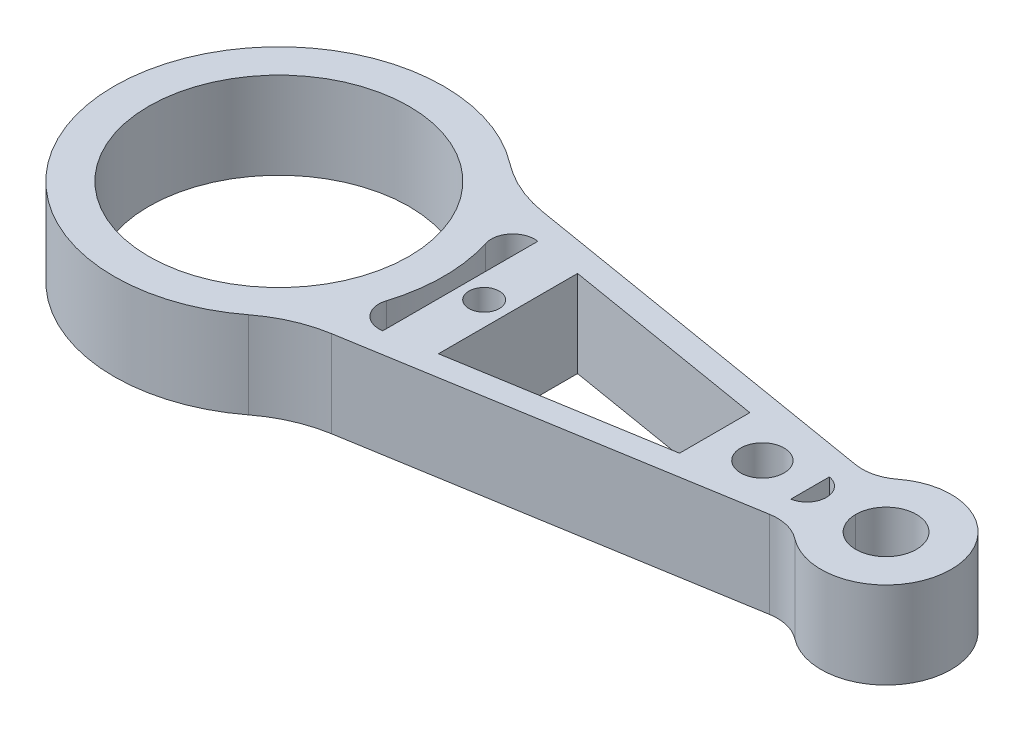
ISO-10303-21;
HEADER;
FILE_DESCRIPTION(('STEP AP214'),'2;1');
FILE_NAME('part.step','',(''),(''),'','','');
FILE_SCHEMA(('AUTOMOTIVE_DESIGN { 1 0 10303 214 1 1 1 1 }'));
ENDSEC;
DATA;
#1=APPLICATION_CONTEXT('core data for automotive mechanical design processes');
#2=APPLICATION_PROTOCOL_DEFINITION('international standard','automotive_design',2000,#1);
#3=PRODUCT_CONTEXT('',#1,'mechanical');
#4=PRODUCT('Part','Part','',(#3));
#5=PRODUCT_RELATED_PRODUCT_CATEGORY('part','',(#4));
#6=PRODUCT_DEFINITION_FORMATION('','',#4);
#7=PRODUCT_DEFINITION_CONTEXT('part definition',#1,'design');
#8=PRODUCT_DEFINITION('design','',#6,#7);
#9=PRODUCT_DEFINITION_SHAPE('','',#8);
#10=(LENGTH_UNIT() NAMED_UNIT(*) SI_UNIT(.MILLI.,.METRE.));
#11=(NAMED_UNIT(*) PLANE_ANGLE_UNIT() SI_UNIT($,.RADIAN.));
#12=(NAMED_UNIT(*) SI_UNIT($,.STERADIAN.) SOLID_ANGLE_UNIT());
#13=UNCERTAINTY_MEASURE_WITH_UNIT(LENGTH_MEASURE(1.E-05),#10,'distance_accuracy_value','');
#14=(GEOMETRIC_REPRESENTATION_CONTEXT(3) GLOBAL_UNCERTAINTY_ASSIGNED_CONTEXT((#13)) GLOBAL_UNIT_ASSIGNED_CONTEXT((#10,
#11,#12)) REPRESENTATION_CONTEXT('',''));
#15=CARTESIAN_POINT('',(0.,0.,0.));
#16=DIRECTION('',(0.,0.,1.));
#17=DIRECTION('',(1.,0.,0.));
#18=AXIS2_PLACEMENT_3D('',#15,#16,#17);
#19=CARTESIAN_POINT('',(140.,10.,0.));
#20=DIRECTION('',(0.,-1.,0.));
#21=DIRECTION('',(0.,0.,-1.));
#22=AXIS2_PLACEMENT_3D('',#19,#20,#21);
#23=CYLINDRICAL_SURFACE('',#22,7.00000000000001);
#24=CARTESIAN_POINT('',(140.,10.,0.));
#25=DIRECTION('',(0.,1.,0.));
#26=DIRECTION('',(0.,0.,1.));
#27=AXIS2_PLACEMENT_3D('',#24,#25,#26);
#28=CIRCLE('',#27,7.00000000000001);
#29=CARTESIAN_POINT('',(147.,10.,0.));
#30=VERTEX_POINT('',#29);
#31=CARTESIAN_POINT('',(133.,10.,0.));
#32=VERTEX_POINT('',#31);
#33=EDGE_CURVE('E316',#30,#32,#28,.T.);
#34=ORIENTED_EDGE('',*,*,#33,.T.);
#35=DIRECTION('',(0.,-1.,0.));
#36=VECTOR('',#35,1.);
#37=CARTESIAN_POINT('',(133.,10.,0.));
#38=LINE('',#37,#36);
#39=CARTESIAN_POINT('',(133.,-10.,0.));
#40=VERTEX_POINT('',#39);
#41=EDGE_CURVE('E11',#32,#40,#38,.T.);
#42=ORIENTED_EDGE('',*,*,#41,.T.);
#43=CARTESIAN_POINT('',(140.,-10.,0.));
#44=DIRECTION('',(0.,1.,0.));
#45=DIRECTION('',(0.,0.,1.));
#46=AXIS2_PLACEMENT_3D('',#43,#44,#45);
#47=CIRCLE('',#46,7.00000000000001);
#48=CARTESIAN_POINT('',(147.,-10.,0.));
#49=VERTEX_POINT('',#48);
#50=EDGE_CURVE('E300',#49,#40,#47,.T.);
#51=ORIENTED_EDGE('',*,*,#50,.F.);
#52=DIRECTION('',(0.,1.,0.));
#53=VECTOR('',#52,1.);
#54=CARTESIAN_POINT('',(147.,10.,0.));
#55=LINE('',#54,#53);
#56=EDGE_CURVE('E52',#49,#30,#55,.T.);
#57=ORIENTED_EDGE('',*,*,#56,.T.);
#58=EDGE_LOOP('',(#34,#42,#51,#57));
#59=FACE_BOUND('',#58,.T.);
#60=ADVANCED_FACE('F43',(#59),#23,.F.);
#61=CARTESIAN_POINT('',(0.,10.,0.));
#62=DIRECTION('',(0.,1.,0.));
#63=DIRECTION('',(0.,0.,1.));
#64=AXIS2_PLACEMENT_3D('',#61,#62,#63);
#65=PLANE('',#64);
#66=CARTESIAN_POINT('',(47.3285545583335,10.,0.));
#67=DIRECTION('',(0.,1.,0.));
#68=DIRECTION('',(0.,0.,1.));
#69=AXIS2_PLACEMENT_3D('',#66,#67,#68);
#70=CIRCLE('',#69,3.5);
#71=CARTESIAN_POINT('',(47.3285545583335,10.,3.5));
#72=VERTEX_POINT('',#71);
#73=EDGE_CURVE('E418',#72,#72,#70,.T.);
#74=ORIENTED_EDGE('',*,*,#73,.F.);
#75=EDGE_LOOP('',(#74));
#76=FACE_BOUND('',#75,.T.);
#77=CARTESIAN_POINT('',(111.478416149068,10.,0.));
#78=DIRECTION('',(0.,1.,0.));
#79=DIRECTION('',(0.,0.,1.));
#80=AXIS2_PLACEMENT_3D('',#77,#78,#79);
#81=CIRCLE('',#80,5.);
#82=CARTESIAN_POINT('',(111.478416149068,10.,5.));
#83=VERTEX_POINT('',#82);
#84=EDGE_CURVE('E410',#83,#83,#81,.T.);
#85=ORIENTED_EDGE('',*,*,#84,.F.);
#86=EDGE_LOOP('',(#85));
#87=FACE_BOUND('',#86,.T.);
#88=DIRECTION('',(-0.986412795984335,0.,-0.164285714285714));
#89=VECTOR('',#88,1.);
#90=CARTESIAN_POINT('',(41.8285545583335,10.,-17.8709827250915));
#91=LINE('',#90,#89);
#92=CARTESIAN_POINT('',(100.478416149068,10.,-8.10292776532473));
#93=VERTEX_POINT('',#92);
#94=CARTESIAN_POINT('',(52.8285545583335,10.,-16.0389476333938));
#95=VERTEX_POINT('',#94);
#96=EDGE_CURVE('E185',#93,#95,#91,.T.);
#97=ORIENTED_EDGE('',*,*,#96,.F.);
#98=DIRECTION('',(0.,0.,1.));
#99=VECTOR('',#98,1.);
#100=CARTESIAN_POINT('',(100.478416149068,10.,8.10292776532473));
#101=LINE('',#100,#99);
#102=CARTESIAN_POINT('',(100.478416149068,10.,8.10292776532473));
#103=VERTEX_POINT('',#102);
#104=EDGE_CURVE('E203',#93,#103,#101,.T.);
#105=ORIENTED_EDGE('',*,*,#104,.T.);
#106=DIRECTION('',(0.986412795984335,0.,-0.164285714285714));
#107=VECTOR('',#106,1.);
#108=CARTESIAN_POINT('',(122.478416149068,10.,4.4388575819295));
#109=LINE('',#108,#107);
#110=CARTESIAN_POINT('',(52.8285545583335,10.,16.0389476333938));
#111=VERTEX_POINT('',#110);
#112=EDGE_CURVE('E186',#111,#103,#109,.T.);
#113=ORIENTED_EDGE('',*,*,#112,.F.);
#114=DIRECTION('',(0.,0.,-1.));
#115=VECTOR('',#114,1.);
#116=CARTESIAN_POINT('',(52.8285545583335,10.,-16.0389476333938));
#117=LINE('',#116,#115);
#118=EDGE_CURVE('E227',#111,#95,#117,.T.);
#119=ORIENTED_EDGE('',*,*,#118,.T.);
#120=EDGE_LOOP('',(#97,#105,#113,#119));
#121=FACE_BOUND('',#120,.T.);
#122=CARTESIAN_POINT('',(41.0071259869049,10.,-12.9389187451698));
#123=DIRECTION('',(0.,1.,0.));
#124=DIRECTION('',(0.,0.,-1.));
#125=AXIS2_PLACEMENT_3D('',#122,#123,#124);
#126=CIRCLE('',#125,5.);
#127=CARTESIAN_POINT('',(41.8285545583335,10.,-17.8709827250915));
#128=VERTEX_POINT('',#127);
#129=CARTESIAN_POINT('',(36.2388555233113,10.,-11.4343933096849));
#130=VERTEX_POINT('',#129);
#131=EDGE_CURVE('E242',#128,#130,#126,.T.);
#132=ORIENTED_EDGE('',*,*,#131,.F.);
#133=DIRECTION('',(0.,0.,1.));
#134=VECTOR('',#133,1.);
#135=CARTESIAN_POINT('',(41.8285545583335,10.,17.8709827250915));
#136=LINE('',#135,#134);
#137=CARTESIAN_POINT('',(41.8285545583335,10.,17.8709827250915));
#138=VERTEX_POINT('',#137);
#139=EDGE_CURVE('E217',#128,#138,#136,.T.);
#140=ORIENTED_EDGE('',*,*,#139,.T.);
#141=CARTESIAN_POINT('',(41.0071259869049,10.,12.9389187451698));
#142=DIRECTION('',(0.,1.,0.));
#143=DIRECTION('',(0.,0.,1.));
#144=AXIS2_PLACEMENT_3D('',#141,#142,#143);
#145=CIRCLE('',#144,5.);
#146=CARTESIAN_POINT('',(36.2388555233113,10.,11.4343933096849));
#147=VERTEX_POINT('',#146);
#148=EDGE_CURVE('E272',#147,#138,#145,.T.);
#149=ORIENTED_EDGE('',*,*,#148,.F.);
#150=CARTESIAN_POINT('',(0.,10.,0.));
#151=DIRECTION('',(0.,-1.,0.));
#152=DIRECTION('',(0.,0.,-1.));
#153=AXIS2_PLACEMENT_3D('',#150,#151,#152);
#154=CIRCLE('',#153,38.);
#155=EDGE_CURVE('E268',#130,#147,#154,.T.);
#156=ORIENTED_EDGE('',*,*,#155,.F.);
#157=EDGE_LOOP('',(#132,#140,#149,#156));
#158=FACE_BOUND('',#157,.T.);
#159=ORIENTED_EDGE('',*,*,#33,.F.);
#160=EDGE_CURVE('E315',#32,#30,#28,.T.);
#161=ORIENTED_EDGE('',*,*,#160,.F.);
#162=EDGE_LOOP('',(#159,#161));
#163=FACE_BOUND('',#162,.T.);
#164=DIRECTION('',(-0.986412795984335,0.,0.164285714285714));
#165=VECTOR('',#164,1.);
#166=CARTESIAN_POINT('',(4.92857142857143,10.,29.59238387953));
#167=LINE('',#166,#165);
#168=CARTESIAN_POINT('',(123.068754783715,10.,9.91629645714705));
#169=VERTEX_POINT('',#168);
#170=CARTESIAN_POINT('',(36.4937809000701,10.,24.3352410223872));
#171=VERTEX_POINT('',#170);
#172=EDGE_CURVE('E312',#169,#171,#167,.T.);
#173=ORIENTED_EDGE('',*,*,#172,.F.);
#174=CARTESIAN_POINT('',(124.711611926572,10.,19.7804244169904));
#175=DIRECTION('',(0.,1.,0.));
#176=DIRECTION('',(0.,0.,1.));
#177=AXIS2_PLACEMENT_3D('',#174,#175,#176);
#178=CIRCLE('',#177,10.);
#179=CARTESIAN_POINT('',(130.826967155943,10.,11.8682546501942));
#180=VERTEX_POINT('',#179);
#181=EDGE_CURVE('E386',#169,#180,#178,.F.);
#182=ORIENTED_EDGE('',*,*,#181,.T.);
#183=CARTESIAN_POINT('',(140.,10.,0.));
#184=DIRECTION('',(0.,1.,0.));
#185=DIRECTION('',(0.,0.,1.));
#186=AXIS2_PLACEMENT_3D('',#183,#184,#185);
#187=CIRCLE('',#186,15.);
#188=CARTESIAN_POINT('',(130.826967155943,10.,-11.8682546501942));
#189=VERTEX_POINT('',#188);
#190=EDGE_CURVE('E299',#180,#189,#187,.T.);
#191=ORIENTED_EDGE('',*,*,#190,.T.);
#192=CARTESIAN_POINT('',(124.711611926572,10.,-19.7804244169904));
#193=DIRECTION('',(0.,1.,0.));
#194=DIRECTION('',(0.,0.,1.));
#195=AXIS2_PLACEMENT_3D('',#192,#193,#194);
#196=CIRCLE('',#195,10.);
#197=CARTESIAN_POINT('',(123.068754783715,10.,-9.91629645714703));
#198=VERTEX_POINT('',#197);
#199=EDGE_CURVE('E392',#189,#198,#196,.F.);
#200=ORIENTED_EDGE('',*,*,#199,.T.);
#201=DIRECTION('',(0.986412795984335,0.,0.164285714285714));
#202=VECTOR('',#201,1.);
#203=CARTESIAN_POINT('',(4.92857142857143,10.,-29.59238387953));
#204=LINE('',#203,#202);
#205=CARTESIAN_POINT('',(36.4937809000701,10.,-24.3352410223872));
#206=VERTEX_POINT('',#205);
#207=EDGE_CURVE('E304',#206,#198,#204,.T.);
#208=ORIENTED_EDGE('',*,*,#207,.F.);
#209=CARTESIAN_POINT('',(41.4223523286415,10.,-53.9276249019172));
#210=DIRECTION('',(0.,1.,0.));
#211=DIRECTION('',(0.,0.,1.));
#212=AXIS2_PLACEMENT_3D('',#209,#210,#211);
#213=CIRCLE('',#212,30.);
#214=CARTESIAN_POINT('',(23.1477851248291,10.,-30.1360256804832));
#215=VERTEX_POINT('',#214);
#216=EDGE_CURVE('E366',#206,#215,#213,.F.);
#217=ORIENTED_EDGE('',*,*,#216,.T.);
#218=CARTESIAN_POINT('',(0.,10.,0.));
#219=DIRECTION('',(0.,1.,0.));
#220=DIRECTION('',(0.,0.,1.));
#221=AXIS2_PLACEMENT_3D('',#218,#219,#220);
#222=CIRCLE('',#221,38.);
#223=CARTESIAN_POINT('',(23.1477851248291,10.,30.1360256804832));
#224=VERTEX_POINT('',#223);
#225=EDGE_CURVE('E308',#215,#224,#222,.T.);
#226=ORIENTED_EDGE('',*,*,#225,.T.);
#227=CARTESIAN_POINT('',(41.4223523286415,10.,53.9276249019172));
#228=DIRECTION('',(0.,1.,0.));
#229=DIRECTION('',(0.,0.,1.));
#230=AXIS2_PLACEMENT_3D('',#227,#228,#229);
#231=CIRCLE('',#230,30.);
#232=EDGE_CURVE('E359',#224,#171,#231,.F.);
#233=ORIENTED_EDGE('',*,*,#232,.T.);
#234=EDGE_LOOP('',(#173,#182,#191,#200,#208,#217,#226,#233));
#235=FACE_BOUND('',#234,.T.);
#236=CARTESIAN_POINT('',(0.,10.,0.));
#237=DIRECTION('',(0.,1.,0.));
#238=DIRECTION('',(0.,0.,1.));
#239=AXIS2_PLACEMENT_3D('',#236,#237,#238);
#240=CIRCLE('',#239,30.);
#241=CARTESIAN_POINT('',(0.,10.,30.));
#242=VERTEX_POINT('',#241);
#243=EDGE_CURVE('E295',#242,#242,#240,.T.);
#244=ORIENTED_EDGE('',*,*,#243,.F.);
#245=EDGE_LOOP('',(#244));
#246=FACE_BOUND('',#245,.T.);
#247=DIRECTION('',(0.,0.,-1.));
#248=VECTOR('',#247,1.);
#249=CARTESIAN_POINT('',(122.478416149068,10.,-4.4388575819295));
#250=LINE('',#249,#248);
#251=CARTESIAN_POINT('',(122.478416149068,10.,4.4388575819295));
#252=VERTEX_POINT('',#251);
#253=CARTESIAN_POINT('',(122.478416149068,10.,-4.4388575819295));
#254=VERTEX_POINT('',#253);
#255=EDGE_CURVE('E181',#252,#254,#250,.T.);
#256=ORIENTED_EDGE('',*,*,#255,.T.);
#257=CARTESIAN_POINT('',(121.739130434783,10.,0.));
#258=DIRECTION('',(0.,1.,0.));
#259=DIRECTION('',(0.,0.,1.));
#260=AXIS2_PLACEMENT_3D('',#257,#258,#259);
#261=CIRCLE('',#260,4.5);
#262=EDGE_CURVE('E177',#252,#254,#261,.T.);
#263=ORIENTED_EDGE('',*,*,#262,.F.);
#264=EDGE_LOOP('',(#256,#263));
#265=FACE_BOUND('',#264,.T.);
#266=ADVANCED_FACE('F179',(#76,#87,#121,#158,#163,#235,#246,#265),#65,.T.);
#267=CARTESIAN_POINT('',(0.,-10.,0.));
#268=DIRECTION('',(0.,1.,0.));
#269=DIRECTION('',(0.,0.,1.));
#270=AXIS2_PLACEMENT_3D('',#267,#268,#269);
#271=PLANE('',#270);
#272=CARTESIAN_POINT('',(47.3285545583335,-10.,0.));
#273=DIRECTION('',(0.,1.,0.));
#274=DIRECTION('',(0.,0.,1.));
#275=AXIS2_PLACEMENT_3D('',#272,#273,#274);
#276=CIRCLE('',#275,3.5);
#277=CARTESIAN_POINT('',(47.3285545583335,-10.,3.5));
#278=VERTEX_POINT('',#277);
#279=EDGE_CURVE('E211',#278,#278,#276,.T.);
#280=ORIENTED_EDGE('',*,*,#279,.T.);
#281=EDGE_LOOP('',(#280));
#282=FACE_BOUND('',#281,.T.);
#283=CARTESIAN_POINT('',(111.478416149068,-10.,0.));
#284=DIRECTION('',(0.,1.,0.));
#285=DIRECTION('',(0.,0.,1.));
#286=AXIS2_PLACEMENT_3D('',#283,#284,#285);
#287=CIRCLE('',#286,5.);
#288=CARTESIAN_POINT('',(111.478416149068,-10.,5.));
#289=VERTEX_POINT('',#288);
#290=EDGE_CURVE('E414',#289,#289,#287,.T.);
#291=ORIENTED_EDGE('',*,*,#290,.T.);
#292=EDGE_LOOP('',(#291));
#293=FACE_BOUND('',#292,.T.);
#294=DIRECTION('',(0.,0.,1.));
#295=VECTOR('',#294,1.);
#296=CARTESIAN_POINT('',(100.478416149068,-10.,8.10292776532473));
#297=LINE('',#296,#295);
#298=CARTESIAN_POINT('',(100.478416149068,-10.,-8.10292776532473));
#299=VERTEX_POINT('',#298);
#300=CARTESIAN_POINT('',(100.478416149068,-10.,8.10292776532473));
#301=VERTEX_POINT('',#300);
#302=EDGE_CURVE('E202',#299,#301,#297,.T.);
#303=ORIENTED_EDGE('',*,*,#302,.F.);
#304=DIRECTION('',(-0.986412795984335,0.,-0.164285714285714));
#305=VECTOR('',#304,1.);
#306=CARTESIAN_POINT('',(41.8285545583335,-10.,-17.8709827250915));
#307=LINE('',#306,#305);
#308=CARTESIAN_POINT('',(52.8285545583335,-10.,-16.0389476333938));
#309=VERTEX_POINT('',#308);
#310=EDGE_CURVE('E59',#299,#309,#307,.T.);
#311=ORIENTED_EDGE('',*,*,#310,.T.);
#312=DIRECTION('',(0.,0.,-1.));
#313=VECTOR('',#312,1.);
#314=CARTESIAN_POINT('',(52.8285545583335,-10.,-16.0389476333938));
#315=LINE('',#314,#313);
#316=CARTESIAN_POINT('',(52.8285545583335,-10.,16.0389476333938));
#317=VERTEX_POINT('',#316);
#318=EDGE_CURVE('E226',#317,#309,#315,.T.);
#319=ORIENTED_EDGE('',*,*,#318,.F.);
#320=DIRECTION('',(0.986412795984335,0.,-0.164285714285714));
#321=VECTOR('',#320,1.);
#322=CARTESIAN_POINT('',(122.478416149068,-10.,4.4388575819295));
#323=LINE('',#322,#321);
#324=EDGE_CURVE('E257',#317,#301,#323,.T.);
#325=ORIENTED_EDGE('',*,*,#324,.T.);
#326=EDGE_LOOP('',(#303,#311,#319,#325));
#327=FACE_BOUND('',#326,.T.);
#328=DIRECTION('',(0.,0.,1.));
#329=VECTOR('',#328,1.);
#330=CARTESIAN_POINT('',(41.8285545583335,-10.,17.8709827250915));
#331=LINE('',#330,#329);
#332=CARTESIAN_POINT('',(41.8285545583335,-10.,-17.8709827250915));
#333=VERTEX_POINT('',#332);
#334=CARTESIAN_POINT('',(41.8285545583335,-10.,17.8709827250915));
#335=VERTEX_POINT('',#334);
#336=EDGE_CURVE('E222',#333,#335,#331,.T.);
#337=ORIENTED_EDGE('',*,*,#336,.F.);
#338=CARTESIAN_POINT('',(41.0071259869049,-10.,-12.9389187451698));
#339=DIRECTION('',(0.,1.,0.));
#340=DIRECTION('',(0.,0.,-1.));
#341=AXIS2_PLACEMENT_3D('',#338,#339,#340);
#342=CIRCLE('',#341,5.);
#343=CARTESIAN_POINT('',(36.2388555233113,-10.,-11.4343933096849));
#344=VERTEX_POINT('',#343);
#345=EDGE_CURVE('E245',#333,#344,#342,.T.);
#346=ORIENTED_EDGE('',*,*,#345,.T.);
#347=CARTESIAN_POINT('',(0.,-10.,0.));
#348=DIRECTION('',(0.,-1.,0.));
#349=DIRECTION('',(0.,0.,-1.));
#350=AXIS2_PLACEMENT_3D('',#347,#348,#349);
#351=CIRCLE('',#350,38.);
#352=CARTESIAN_POINT('',(36.2388555233113,-10.,11.4343933096849));
#353=VERTEX_POINT('',#352);
#354=EDGE_CURVE('E249',#344,#353,#351,.T.);
#355=ORIENTED_EDGE('',*,*,#354,.T.);
#356=CARTESIAN_POINT('',(41.0071259869049,-10.,12.9389187451698));
#357=DIRECTION('',(0.,1.,0.));
#358=DIRECTION('',(0.,0.,1.));
#359=AXIS2_PLACEMENT_3D('',#356,#357,#358);
#360=CIRCLE('',#359,5.);
#361=EDGE_CURVE('E253',#353,#335,#360,.T.);
#362=ORIENTED_EDGE('',*,*,#361,.T.);
#363=EDGE_LOOP('',(#337,#346,#355,#362));
#364=FACE_BOUND('',#363,.T.);
#365=CARTESIAN_POINT('',(0.,-10.,0.));
#366=DIRECTION('',(0.,1.,0.));
#367=DIRECTION('',(0.,0.,1.));
#368=AXIS2_PLACEMENT_3D('',#365,#366,#367);
#369=CIRCLE('',#368,30.);
#370=CARTESIAN_POINT('',(0.,-10.,30.));
#371=VERTEX_POINT('',#370);
#372=EDGE_CURVE('E283',#371,#371,#369,.T.);
#373=ORIENTED_EDGE('',*,*,#372,.T.);
#374=EDGE_LOOP('',(#373));
#375=FACE_BOUND('',#374,.T.);
#376=CARTESIAN_POINT('',(140.,-10.,0.));
#377=DIRECTION('',(0.,1.,0.));
#378=DIRECTION('',(0.,0.,1.));
#379=AXIS2_PLACEMENT_3D('',#376,#377,#378);
#380=CIRCLE('',#379,15.);
#381=CARTESIAN_POINT('',(130.826967155943,-10.,11.8682546501942));
#382=VERTEX_POINT('',#381);
#383=CARTESIAN_POINT('',(130.826967155943,-10.,-11.8682546501942));
#384=VERTEX_POINT('',#383);
#385=EDGE_CURVE('E324',#382,#384,#380,.T.);
#386=ORIENTED_EDGE('',*,*,#385,.F.);
#387=CARTESIAN_POINT('',(124.711611926572,-10.,19.7804244169904));
#388=DIRECTION('',(0.,1.,0.));
#389=DIRECTION('',(0.,0.,1.));
#390=AXIS2_PLACEMENT_3D('',#387,#388,#389);
#391=CIRCLE('',#390,10.);
#392=CARTESIAN_POINT('',(123.068754783715,-10.,9.91629645714705));
#393=VERTEX_POINT('',#392);
#394=EDGE_CURVE('E383',#382,#393,#391,.T.);
#395=ORIENTED_EDGE('',*,*,#394,.T.);
#396=DIRECTION('',(-0.986412795984335,0.,0.164285714285714));
#397=VECTOR('',#396,1.);
#398=CARTESIAN_POINT('',(4.92857142857143,-10.,29.59238387953));
#399=LINE('',#398,#397);
#400=CARTESIAN_POINT('',(36.4937809000701,-10.,24.3352410223872));
#401=VERTEX_POINT('',#400);
#402=EDGE_CURVE('E336',#393,#401,#399,.T.);
#403=ORIENTED_EDGE('',*,*,#402,.T.);
#404=CARTESIAN_POINT('',(41.4223523286415,-10.,53.9276249019172));
#405=DIRECTION('',(0.,1.,0.));
#406=DIRECTION('',(0.,0.,1.));
#407=AXIS2_PLACEMENT_3D('',#404,#405,#406);
#408=CIRCLE('',#407,30.);
#409=CARTESIAN_POINT('',(23.1477851248291,-10.,30.1360256804832));
#410=VERTEX_POINT('',#409);
#411=EDGE_CURVE('E356',#401,#410,#408,.T.);
#412=ORIENTED_EDGE('',*,*,#411,.T.);
#413=CARTESIAN_POINT('',(0.,-10.,0.));
#414=DIRECTION('',(0.,1.,0.));
#415=DIRECTION('',(0.,0.,1.));
#416=AXIS2_PLACEMENT_3D('',#413,#414,#415);
#417=CIRCLE('',#416,38.);
#418=CARTESIAN_POINT('',(23.1477851248291,-10.,-30.1360256804832));
#419=VERTEX_POINT('',#418);
#420=EDGE_CURVE('E332',#419,#410,#417,.T.);
#421=ORIENTED_EDGE('',*,*,#420,.F.);
#422=CARTESIAN_POINT('',(41.4223523286415,-10.,-53.9276249019172));
#423=DIRECTION('',(0.,1.,0.));
#424=DIRECTION('',(0.,0.,1.));
#425=AXIS2_PLACEMENT_3D('',#422,#423,#424);
#426=CIRCLE('',#425,30.);
#427=CARTESIAN_POINT('',(36.4937809000701,-10.,-24.3352410223872));
#428=VERTEX_POINT('',#427);
#429=EDGE_CURVE('E363',#419,#428,#426,.T.);
#430=ORIENTED_EDGE('',*,*,#429,.T.);
#431=DIRECTION('',(0.986412795984335,0.,0.164285714285714));
#432=VECTOR('',#431,1.);
#433=CARTESIAN_POINT('',(4.92857142857143,-10.,-29.59238387953));
#434=LINE('',#433,#432);
#435=CARTESIAN_POINT('',(123.068754783715,-10.,-9.91629645714703));
#436=VERTEX_POINT('',#435);
#437=EDGE_CURVE('E328',#428,#436,#434,.T.);
#438=ORIENTED_EDGE('',*,*,#437,.T.);
#439=CARTESIAN_POINT('',(124.711611926572,-10.,-19.7804244169904));
#440=DIRECTION('',(0.,1.,0.));
#441=DIRECTION('',(0.,0.,1.));
#442=AXIS2_PLACEMENT_3D('',#439,#440,#441);
#443=CIRCLE('',#442,10.);
#444=EDGE_CURVE('E389',#436,#384,#443,.T.);
#445=ORIENTED_EDGE('',*,*,#444,.T.);
#446=EDGE_LOOP('',(#386,#395,#403,#412,#421,#430,#438,#445));
#447=FACE_BOUND('',#446,.T.);
#448=ORIENTED_EDGE('',*,*,#50,.T.);
#449=EDGE_CURVE('E339',#40,#49,#47,.T.);
#450=ORIENTED_EDGE('',*,*,#449,.T.);
#451=EDGE_LOOP('',(#448,#450));
#452=FACE_BOUND('',#451,.T.);
#453=CARTESIAN_POINT('',(121.739130434783,-10.,0.));
#454=DIRECTION('',(0.,1.,0.));
#455=DIRECTION('',(0.,0.,1.));
#456=AXIS2_PLACEMENT_3D('',#453,#454,#455);
#457=CIRCLE('',#456,4.5);
#458=CARTESIAN_POINT('',(122.478416149068,-10.,4.4388575819295));
#459=VERTEX_POINT('',#458);
#460=CARTESIAN_POINT('',(122.478416149068,-10.,-4.4388575819295));
#461=VERTEX_POINT('',#460);
#462=EDGE_CURVE('E192',#459,#461,#457,.T.);
#463=ORIENTED_EDGE('',*,*,#462,.T.);
#464=DIRECTION('',(0.,0.,-1.));
#465=VECTOR('',#464,1.);
#466=CARTESIAN_POINT('',(122.478416149068,-10.,-4.4388575819295));
#467=LINE('',#466,#465);
#468=EDGE_CURVE('E208',#459,#461,#467,.T.);
#469=ORIENTED_EDGE('',*,*,#468,.F.);
#470=EDGE_LOOP('',(#463,#469));
#471=FACE_BOUND('',#470,.T.);
#472=ADVANCED_FACE('F426',(#282,#293,#327,#364,#375,#447,#452,#471),#271,.F.);
#473=CARTESIAN_POINT('',(140.,10.,0.));
#474=DIRECTION('',(0.,-1.,0.));
#475=DIRECTION('',(0.,0.,-1.));
#476=AXIS2_PLACEMENT_3D('',#473,#474,#475);
#477=CYLINDRICAL_SURFACE('',#476,15.);
#478=ORIENTED_EDGE('',*,*,#190,.F.);
#479=DIRECTION('',(0.,-1.,0.));
#480=VECTOR('',#479,1.);
#481=CARTESIAN_POINT('',(130.826967155943,10.,11.8682546501942));
#482=LINE('',#481,#480);
#483=EDGE_CURVE('E372',#180,#382,#482,.T.);
#484=ORIENTED_EDGE('',*,*,#483,.T.);
#485=ORIENTED_EDGE('',*,*,#385,.T.);
#486=DIRECTION('',(0.,-1.,0.));
#487=VECTOR('',#486,1.);
#488=CARTESIAN_POINT('',(130.826967155943,10.,-11.8682546501942));
#489=LINE('',#488,#487);
#490=EDGE_CURVE('E369',#384,#189,#489,.F.);
#491=ORIENTED_EDGE('',*,*,#490,.T.);
#492=EDGE_LOOP('',(#478,#484,#485,#491));
#493=FACE_BOUND('',#492,.T.);
#494=ADVANCED_FACE('F494',(#493),#477,.T.);
#495=CARTESIAN_POINT('',(4.92857142857143,10.,-29.59238387953));
#496=DIRECTION('',(0.164285714285714,0.,-0.986412795984335));
#497=DIRECTION('',(-0.986412795984335,0.,-0.164285714285714));
#498=AXIS2_PLACEMENT_3D('',#495,#496,#497);
#499=PLANE('',#498);
#500=ORIENTED_EDGE('',*,*,#207,.T.);
#501=DIRECTION('',(0.,-1.,0.));
#502=VECTOR('',#501,1.);
#503=CARTESIAN_POINT('',(123.068754783715,10.,-9.91629645714703));
#504=LINE('',#503,#502);
#505=EDGE_CURVE('E379',#198,#436,#504,.T.);
#506=ORIENTED_EDGE('',*,*,#505,.T.);
#507=ORIENTED_EDGE('',*,*,#437,.F.);
#508=DIRECTION('',(0.,-1.,0.));
#509=VECTOR('',#508,1.);
#510=CARTESIAN_POINT('',(36.4937809000701,10.,-24.3352410223872));
#511=LINE('',#510,#509);
#512=EDGE_CURVE('E353',#428,#206,#511,.F.);
#513=ORIENTED_EDGE('',*,*,#512,.T.);
#514=EDGE_LOOP('',(#500,#506,#507,#513));
#515=FACE_BOUND('',#514,.T.);
#516=ADVANCED_FACE('F498',(#515),#499,.T.);
#517=CARTESIAN_POINT('',(0.,10.,0.));
#518=DIRECTION('',(0.,-1.,0.));
#519=DIRECTION('',(0.,0.,-1.));
#520=AXIS2_PLACEMENT_3D('',#517,#518,#519);
#521=CYLINDRICAL_SURFACE('',#520,38.);
#522=ORIENTED_EDGE('',*,*,#420,.T.);
#523=DIRECTION('',(0.,-1.,0.));
#524=VECTOR('',#523,1.);
#525=CARTESIAN_POINT('',(23.1477851248291,10.,30.1360256804832));
#526=LINE('',#525,#524);
#527=EDGE_CURVE('E350',#410,#224,#526,.F.);
#528=ORIENTED_EDGE('',*,*,#527,.T.);
#529=ORIENTED_EDGE('',*,*,#225,.F.);
#530=DIRECTION('',(0.,-1.,0.));
#531=VECTOR('',#530,1.);
#532=CARTESIAN_POINT('',(23.1477851248291,10.,-30.1360256804832));
#533=LINE('',#532,#531);
#534=EDGE_CURVE('E346',#215,#419,#533,.T.);
#535=ORIENTED_EDGE('',*,*,#534,.T.);
#536=EDGE_LOOP('',(#522,#528,#529,#535));
#537=FACE_BOUND('',#536,.T.);
#538=ADVANCED_FACE('F530',(#537),#521,.T.);
#539=CARTESIAN_POINT('',(4.92857142857143,10.,29.59238387953));
#540=DIRECTION('',(0.164285714285714,0.,0.986412795984335));
#541=DIRECTION('',(0.986412795984335,0.,-0.164285714285714));
#542=AXIS2_PLACEMENT_3D('',#539,#540,#541);
#543=PLANE('',#542);
#544=ORIENTED_EDGE('',*,*,#402,.F.);
#545=DIRECTION('',(0.,-1.,0.));
#546=VECTOR('',#545,1.);
#547=CARTESIAN_POINT('',(123.068754783715,10.,9.91629645714705));
#548=LINE('',#547,#546);
#549=EDGE_CURVE('E376',#393,#169,#548,.F.);
#550=ORIENTED_EDGE('',*,*,#549,.T.);
#551=ORIENTED_EDGE('',*,*,#172,.T.);
#552=DIRECTION('',(0.,-1.,0.));
#553=VECTOR('',#552,1.);
#554=CARTESIAN_POINT('',(36.4937809000701,10.,24.3352410223872));
#555=LINE('',#554,#553);
#556=EDGE_CURVE('E320',#171,#401,#555,.T.);
#557=ORIENTED_EDGE('',*,*,#556,.T.);
#558=EDGE_LOOP('',(#544,#550,#551,#557));
#559=FACE_BOUND('',#558,.T.);
#560=ADVANCED_FACE('F488',(#559),#543,.T.);
#561=CARTESIAN_POINT('',(0.,10.,0.));
#562=DIRECTION('',(0.,-1.,0.));
#563=DIRECTION('',(0.,0.,-1.));
#564=AXIS2_PLACEMENT_3D('',#561,#562,#563);
#565=CYLINDRICAL_SURFACE('',#564,30.);
#566=ORIENTED_EDGE('',*,*,#243,.T.);
#567=EDGE_LOOP('',(#566));
#568=FACE_BOUND('',#567,.T.);
#569=ORIENTED_EDGE('',*,*,#372,.F.);
#570=EDGE_LOOP('',(#569));
#571=FACE_BOUND('',#570,.T.);
#572=ADVANCED_FACE('F480',(#568,#571),#565,.F.);
#573=ORIENTED_EDGE('',*,*,#41,.F.);
#574=ORIENTED_EDGE('',*,*,#160,.T.);
#575=ORIENTED_EDGE('',*,*,#56,.F.);
#576=ORIENTED_EDGE('',*,*,#449,.F.);
#577=EDGE_LOOP('',(#573,#574,#575,#576));
#578=FACE_BOUND('',#577,.T.);
#579=ADVANCED_FACE('F473',(#578),#23,.F.);
#580=CARTESIAN_POINT('',(41.4223523286415,10.,53.9276249019172));
#581=DIRECTION('',(0.,-1.,0.));
#582=DIRECTION('',(0.,0.,-1.));
#583=AXIS2_PLACEMENT_3D('',#580,#581,#582);
#584=CYLINDRICAL_SURFACE('',#583,30.);
#585=ORIENTED_EDGE('',*,*,#232,.F.);
#586=ORIENTED_EDGE('',*,*,#527,.F.);
#587=ORIENTED_EDGE('',*,*,#411,.F.);
#588=ORIENTED_EDGE('',*,*,#556,.F.);
#589=EDGE_LOOP('',(#585,#586,#587,#588));
#590=FACE_BOUND('',#589,.T.);
#591=ADVANCED_FACE('F479',(#590),#584,.F.);
#592=CARTESIAN_POINT('',(41.4223523286415,10.,-53.9276249019172));
#593=DIRECTION('',(0.,-1.,0.));
#594=DIRECTION('',(0.,0.,-1.));
#595=AXIS2_PLACEMENT_3D('',#592,#593,#594);
#596=CYLINDRICAL_SURFACE('',#595,30.);
#597=ORIENTED_EDGE('',*,*,#216,.F.);
#598=ORIENTED_EDGE('',*,*,#512,.F.);
#599=ORIENTED_EDGE('',*,*,#429,.F.);
#600=ORIENTED_EDGE('',*,*,#534,.F.);
#601=EDGE_LOOP('',(#597,#598,#599,#600));
#602=FACE_BOUND('',#601,.T.);
#603=ADVANCED_FACE('F485',(#602),#596,.F.);
#604=CARTESIAN_POINT('',(124.711611926572,10.,19.7804244169904));
#605=DIRECTION('',(0.,-1.,0.));
#606=DIRECTION('',(0.,0.,-1.));
#607=AXIS2_PLACEMENT_3D('',#604,#605,#606);
#608=CYLINDRICAL_SURFACE('',#607,10.);
#609=ORIENTED_EDGE('',*,*,#181,.F.);
#610=ORIENTED_EDGE('',*,*,#549,.F.);
#611=ORIENTED_EDGE('',*,*,#394,.F.);
#612=ORIENTED_EDGE('',*,*,#483,.F.);
#613=EDGE_LOOP('',(#609,#610,#611,#612));
#614=FACE_BOUND('',#613,.T.);
#615=ADVANCED_FACE('F508',(#614),#608,.F.);
#616=CARTESIAN_POINT('',(124.711611926572,10.,-19.7804244169904));
#617=DIRECTION('',(0.,-1.,0.));
#618=DIRECTION('',(0.,0.,-1.));
#619=AXIS2_PLACEMENT_3D('',#616,#617,#618);
#620=CYLINDRICAL_SURFACE('',#619,10.);
#621=ORIENTED_EDGE('',*,*,#199,.F.);
#622=ORIENTED_EDGE('',*,*,#490,.F.);
#623=ORIENTED_EDGE('',*,*,#444,.F.);
#624=ORIENTED_EDGE('',*,*,#505,.F.);
#625=EDGE_LOOP('',(#621,#622,#623,#624));
#626=FACE_BOUND('',#625,.T.);
#627=ADVANCED_FACE('F45',(#626),#620,.F.);
#628=CARTESIAN_POINT('',(41.0071259869049,-10.,-12.9389187451698));
#629=DIRECTION('',(0.,1.,0.));
#630=DIRECTION('',(0.,0.,1.));
#631=AXIS2_PLACEMENT_3D('',#628,#629,#630);
#632=CYLINDRICAL_SURFACE('',#631,5.);
#633=ORIENTED_EDGE('',*,*,#131,.T.);
#634=DIRECTION('',(0.,1.,0.));
#635=VECTOR('',#634,1.);
#636=CARTESIAN_POINT('',(36.2388555233113,-10.,-11.4343933096849));
#637=LINE('',#636,#635);
#638=EDGE_CURVE('E265',#344,#130,#637,.T.);
#639=ORIENTED_EDGE('',*,*,#638,.F.);
#640=ORIENTED_EDGE('',*,*,#345,.F.);
#641=DIRECTION('',(0.,1.,0.));
#642=VECTOR('',#641,1.);
#643=CARTESIAN_POINT('',(41.8285545583335,-10.,-17.8709827250915));
#644=LINE('',#643,#642);
#645=EDGE_CURVE('E279',#333,#128,#644,.T.);
#646=ORIENTED_EDGE('',*,*,#645,.T.);
#647=EDGE_LOOP('',(#633,#639,#640,#646));
#648=FACE_BOUND('',#647,.T.);
#649=ADVANCED_FACE('F448',(#648),#632,.F.);
#650=CARTESIAN_POINT('',(41.8285545583335,-10.,-17.8709827250915));
#651=DIRECTION('',(0.164285714285714,0.,-0.986412795984335));
#652=DIRECTION('',(-0.986412795984335,0.,-0.164285714285714));
#653=AXIS2_PLACEMENT_3D('',#650,#651,#652);
#654=PLANE('',#653);
#655=ORIENTED_EDGE('',*,*,#310,.F.);
#656=DIRECTION('',(0.,1.,0.));
#657=VECTOR('',#656,1.);
#658=CARTESIAN_POINT('',(100.478416149068,-10.,-8.10292776532473));
#659=LINE('',#658,#657);
#660=EDGE_CURVE('E63',#299,#93,#659,.T.);
#661=ORIENTED_EDGE('',*,*,#660,.T.);
#662=ORIENTED_EDGE('',*,*,#96,.T.);
#663=DIRECTION('',(0.,1.,0.));
#664=VECTOR('',#663,1.);
#665=CARTESIAN_POINT('',(52.8285545583335,-10.,-16.0389476333938));
#666=LINE('',#665,#664);
#667=EDGE_CURVE('E238',#309,#95,#666,.T.);
#668=ORIENTED_EDGE('',*,*,#667,.F.);
#669=EDGE_LOOP('',(#655,#661,#662,#668));
#670=FACE_BOUND('',#669,.T.);
#671=ADVANCED_FACE('F502',(#670),#654,.F.);
#672=CARTESIAN_POINT('',(121.739130434783,-10.,0.));
#673=DIRECTION('',(0.,1.,0.));
#674=DIRECTION('',(0.,0.,1.));
#675=AXIS2_PLACEMENT_3D('',#672,#673,#674);
#676=CYLINDRICAL_SURFACE('',#675,4.5);
#677=ORIENTED_EDGE('',*,*,#262,.T.);
#678=DIRECTION('',(0.,1.,0.));
#679=VECTOR('',#678,1.);
#680=CARTESIAN_POINT('',(122.478416149068,-10.,-4.4388575819295));
#681=LINE('',#680,#679);
#682=EDGE_CURVE('E197',#461,#254,#681,.T.);
#683=ORIENTED_EDGE('',*,*,#682,.F.);
#684=ORIENTED_EDGE('',*,*,#462,.F.);
#685=DIRECTION('',(0.,1.,0.));
#686=VECTOR('',#685,1.);
#687=CARTESIAN_POINT('',(122.478416149068,-10.,4.4388575819295));
#688=LINE('',#687,#686);
#689=EDGE_CURVE('E189',#459,#252,#688,.T.);
#690=ORIENTED_EDGE('',*,*,#689,.T.);
#691=EDGE_LOOP('',(#677,#683,#684,#690));
#692=FACE_BOUND('',#691,.T.);
#693=ADVANCED_FACE('F190',(#692),#676,.F.);
#694=CARTESIAN_POINT('',(122.478416149068,-10.,4.4388575819295));
#695=DIRECTION('',(0.164285714285714,0.,0.986412795984335));
#696=DIRECTION('',(0.986412795984335,0.,-0.164285714285714));
#697=AXIS2_PLACEMENT_3D('',#694,#695,#696);
#698=PLANE('',#697);
#699=ORIENTED_EDGE('',*,*,#112,.T.);
#700=DIRECTION('',(0.,1.,0.));
#701=VECTOR('',#700,1.);
#702=CARTESIAN_POINT('',(100.478416149068,-10.,8.10292776532473));
#703=LINE('',#702,#701);
#704=EDGE_CURVE('E218',#301,#103,#703,.T.);
#705=ORIENTED_EDGE('',*,*,#704,.F.);
#706=ORIENTED_EDGE('',*,*,#324,.F.);
#707=DIRECTION('',(0.,1.,0.));
#708=VECTOR('',#707,1.);
#709=CARTESIAN_POINT('',(52.8285545583335,-10.,16.0389476333938));
#710=LINE('',#709,#708);
#711=EDGE_CURVE('E231',#317,#111,#710,.T.);
#712=ORIENTED_EDGE('',*,*,#711,.T.);
#713=EDGE_LOOP('',(#699,#705,#706,#712));
#714=FACE_BOUND('',#713,.T.);
#715=ADVANCED_FACE('F468',(#714),#698,.F.);
#716=CARTESIAN_POINT('',(41.0071259869049,-10.,12.9389187451698));
#717=DIRECTION('',(0.,1.,0.));
#718=DIRECTION('',(0.,0.,1.));
#719=AXIS2_PLACEMENT_3D('',#716,#717,#718);
#720=CYLINDRICAL_SURFACE('',#719,5.);
#721=ORIENTED_EDGE('',*,*,#148,.T.);
#722=DIRECTION('',(0.,1.,0.));
#723=VECTOR('',#722,1.);
#724=CARTESIAN_POINT('',(41.8285545583335,-10.,17.8709827250915));
#725=LINE('',#724,#723);
#726=EDGE_CURVE('E198',#335,#138,#725,.T.);
#727=ORIENTED_EDGE('',*,*,#726,.F.);
#728=ORIENTED_EDGE('',*,*,#361,.F.);
#729=DIRECTION('',(0.,1.,0.));
#730=VECTOR('',#729,1.);
#731=CARTESIAN_POINT('',(36.2388555233113,-10.,11.4343933096849));
#732=LINE('',#731,#730);
#733=EDGE_CURVE('E289',#353,#147,#732,.T.);
#734=ORIENTED_EDGE('',*,*,#733,.T.);
#735=EDGE_LOOP('',(#721,#727,#728,#734));
#736=FACE_BOUND('',#735,.T.);
#737=ADVANCED_FACE('F453',(#736),#720,.F.);
#738=CARTESIAN_POINT('',(0.,-10.,0.));
#739=DIRECTION('',(0.,1.,0.));
#740=DIRECTION('',(0.,0.,1.));
#741=AXIS2_PLACEMENT_3D('',#738,#739,#740);
#742=CYLINDRICAL_SURFACE('',#741,38.);
#743=ORIENTED_EDGE('',*,*,#155,.T.);
#744=ORIENTED_EDGE('',*,*,#733,.F.);
#745=ORIENTED_EDGE('',*,*,#354,.F.);
#746=ORIENTED_EDGE('',*,*,#638,.T.);
#747=EDGE_LOOP('',(#743,#744,#745,#746));
#748=FACE_BOUND('',#747,.T.);
#749=ADVANCED_FACE('F459',(#748),#742,.T.);
#750=CARTESIAN_POINT('',(41.8285545583335,-10.,17.8709827250915));
#751=DIRECTION('',(-1.,0.,0.));
#752=DIRECTION('',(0.,0.,1.));
#753=AXIS2_PLACEMENT_3D('',#750,#751,#752);
#754=PLANE('',#753);
#755=ORIENTED_EDGE('',*,*,#139,.F.);
#756=ORIENTED_EDGE('',*,*,#645,.F.);
#757=ORIENTED_EDGE('',*,*,#336,.T.);
#758=ORIENTED_EDGE('',*,*,#726,.T.);
#759=EDGE_LOOP('',(#755,#756,#757,#758));
#760=FACE_BOUND('',#759,.T.);
#761=ADVANCED_FACE('F451',(#760),#754,.T.);
#762=CARTESIAN_POINT('',(52.8285545583335,-10.,-16.0389476333938));
#763=DIRECTION('',(1.,0.,0.));
#764=DIRECTION('',(0.,0.,-1.));
#765=AXIS2_PLACEMENT_3D('',#762,#763,#764);
#766=PLANE('',#765);
#767=ORIENTED_EDGE('',*,*,#118,.F.);
#768=ORIENTED_EDGE('',*,*,#711,.F.);
#769=ORIENTED_EDGE('',*,*,#318,.T.);
#770=ORIENTED_EDGE('',*,*,#667,.T.);
#771=EDGE_LOOP('',(#767,#768,#769,#770));
#772=FACE_BOUND('',#771,.T.);
#773=ADVANCED_FACE('F466',(#772),#766,.T.);
#774=CARTESIAN_POINT('',(100.478416149068,-10.,8.10292776532473));
#775=DIRECTION('',(-1.,0.,0.));
#776=DIRECTION('',(0.,0.,1.));
#777=AXIS2_PLACEMENT_3D('',#774,#775,#776);
#778=PLANE('',#777);
#779=ORIENTED_EDGE('',*,*,#104,.F.);
#780=ORIENTED_EDGE('',*,*,#660,.F.);
#781=ORIENTED_EDGE('',*,*,#302,.T.);
#782=ORIENTED_EDGE('',*,*,#704,.T.);
#783=EDGE_LOOP('',(#779,#780,#781,#782));
#784=FACE_BOUND('',#783,.T.);
#785=ADVANCED_FACE('F633',(#784),#778,.T.);
#786=CARTESIAN_POINT('',(122.478416149068,-10.,-4.4388575819295));
#787=DIRECTION('',(1.,0.,0.));
#788=DIRECTION('',(0.,0.,-1.));
#789=AXIS2_PLACEMENT_3D('',#786,#787,#788);
#790=PLANE('',#789);
#791=ORIENTED_EDGE('',*,*,#255,.F.);
#792=ORIENTED_EDGE('',*,*,#689,.F.);
#793=ORIENTED_EDGE('',*,*,#468,.T.);
#794=ORIENTED_EDGE('',*,*,#682,.T.);
#795=EDGE_LOOP('',(#791,#792,#793,#794));
#796=FACE_BOUND('',#795,.T.);
#797=ADVANCED_FACE('F200',(#796),#790,.T.);
#798=CARTESIAN_POINT('',(111.478416149068,-10.,0.));
#799=DIRECTION('',(0.,1.,0.));
#800=DIRECTION('',(0.,0.,1.));
#801=AXIS2_PLACEMENT_3D('',#798,#799,#800);
#802=CYLINDRICAL_SURFACE('',#801,5.);
#803=ORIENTED_EDGE('',*,*,#290,.F.);
#804=EDGE_LOOP('',(#803));
#805=FACE_BOUND('',#804,.T.);
#806=ORIENTED_EDGE('',*,*,#84,.T.);
#807=EDGE_LOOP('',(#806));
#808=FACE_BOUND('',#807,.T.);
#809=ADVANCED_FACE('F432',(#805,#808),#802,.F.);
#810=CARTESIAN_POINT('',(47.3285545583335,-10.,0.));
#811=DIRECTION('',(0.,1.,0.));
#812=DIRECTION('',(0.,0.,1.));
#813=AXIS2_PLACEMENT_3D('',#810,#811,#812);
#814=CYLINDRICAL_SURFACE('',#813,3.5);
#815=ORIENTED_EDGE('',*,*,#279,.F.);
#816=EDGE_LOOP('',(#815));
#817=FACE_BOUND('',#816,.T.);
#818=ORIENTED_EDGE('',*,*,#73,.T.);
#819=EDGE_LOOP('',(#818));
#820=FACE_BOUND('',#819,.T.);
#821=ADVANCED_FACE('F429',(#817,#820),#814,.F.);
#822=CLOSED_SHELL('',(#60,#266,#472,#494,#516,#538,#560,#572,#579,#591,#603,#615,#627,#649,#671,
#693,#715,#737,#749,#761,#773,#785,#797,#809,#821));
#823=MANIFOLD_SOLID_BREP('B2',#822);
#824=ADVANCED_BREP_SHAPE_REPRESENTATION('',(#18,#823),#14);
#825=SHAPE_DEFINITION_REPRESENTATION(#9,#824);
ENDSEC;
END-ISO-10303-21;
